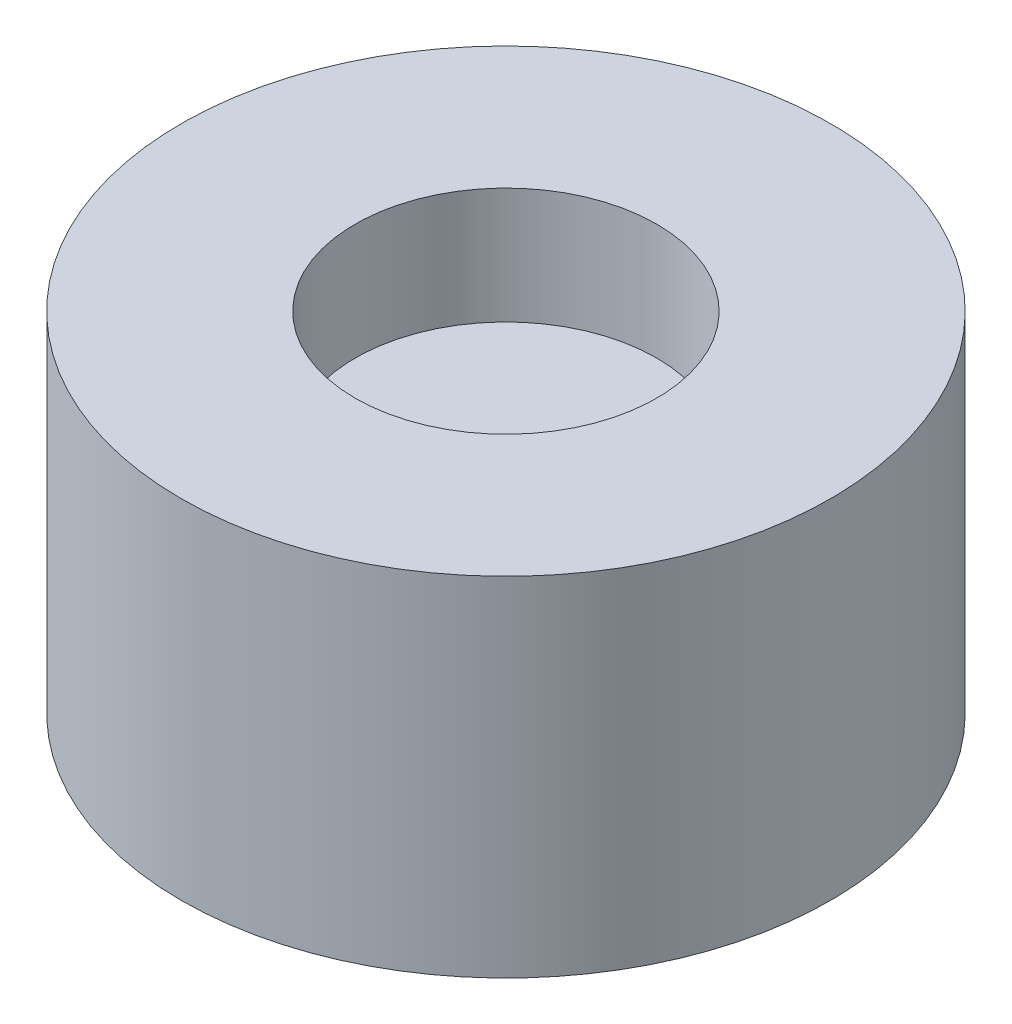
ISO-10303-21;
HEADER;
FILE_DESCRIPTION(('STEP AP214'),'2;1');
FILE_NAME('part.step','',(''),(''),'','','');
FILE_SCHEMA(('AUTOMOTIVE_DESIGN { 1 0 10303 214 1 1 1 1 }'));
ENDSEC;
DATA;
#1=APPLICATION_CONTEXT('core data for automotive mechanical design processes');
#2=APPLICATION_PROTOCOL_DEFINITION('international standard','automotive_design',2000,#1);
#3=PRODUCT_CONTEXT('',#1,'mechanical');
#4=PRODUCT('Part','Part','',(#3));
#5=PRODUCT_RELATED_PRODUCT_CATEGORY('part','',(#4));
#6=PRODUCT_DEFINITION_FORMATION('','',#4);
#7=PRODUCT_DEFINITION_CONTEXT('part definition',#1,'design');
#8=PRODUCT_DEFINITION('design','',#6,#7);
#9=PRODUCT_DEFINITION_SHAPE('','',#8);
#10=(LENGTH_UNIT() NAMED_UNIT(*) SI_UNIT(.MILLI.,.METRE.));
#11=(NAMED_UNIT(*) PLANE_ANGLE_UNIT() SI_UNIT($,.RADIAN.));
#12=(NAMED_UNIT(*) SI_UNIT($,.STERADIAN.) SOLID_ANGLE_UNIT());
#13=UNCERTAINTY_MEASURE_WITH_UNIT(LENGTH_MEASURE(1.E-05),#10,'distance_accuracy_value','');
#14=(GEOMETRIC_REPRESENTATION_CONTEXT(3) GLOBAL_UNCERTAINTY_ASSIGNED_CONTEXT((#13)) GLOBAL_UNIT_ASSIGNED_CONTEXT((#10,
#11,#12)) REPRESENTATION_CONTEXT('',''));
#15=CARTESIAN_POINT('',(0.,0.,0.));
#16=DIRECTION('',(0.,0.,1.));
#17=DIRECTION('',(1.,0.,0.));
#18=AXIS2_PLACEMENT_3D('',#15,#16,#17);
#19=CARTESIAN_POINT('',(0.,6.,0.));
#20=DIRECTION('',(0.,-1.,0.));
#21=DIRECTION('',(0.,0.,-1.));
#22=AXIS2_PLACEMENT_3D('',#19,#20,#21);
#23=CYLINDRICAL_SURFACE('',#22,4.6);
#24=CARTESIAN_POINT('',(0.,3.,0.));
#25=DIRECTION('',(0.,1.,0.));
#26=DIRECTION('',(0.,0.,1.));
#27=AXIS2_PLACEMENT_3D('',#24,#25,#26);
#28=CIRCLE('',#27,4.6);
#29=CARTESIAN_POINT('',(-0.95,3.,-4.50083325618713));
#30=VERTEX_POINT('',#29);
#31=CARTESIAN_POINT('',(0.95,3.,-4.50083325618713));
#32=VERTEX_POINT('',#31);
#33=EDGE_CURVE('E98',#30,#32,#28,.T.);
#34=ORIENTED_EDGE('',*,*,#33,.F.);
#35=DIRECTION('',(0.,-1.,0.));
#36=VECTOR('',#35,1.);
#37=CARTESIAN_POINT('',(-0.95,6.,-4.50083325618713));
#38=LINE('',#37,#36);
#39=CARTESIAN_POINT('',(-0.95,6.,-4.50083325618713));
#40=VERTEX_POINT('',#39);
#41=EDGE_CURVE('E42',#40,#30,#38,.T.);
#42=ORIENTED_EDGE('',*,*,#41,.F.);
#43=CARTESIAN_POINT('',(0.,6.,0.));
#44=DIRECTION('',(0.,1.,0.));
#45=DIRECTION('',(0.,0.,1.));
#46=AXIS2_PLACEMENT_3D('',#43,#44,#45);
#47=CIRCLE('',#46,4.6);
#48=CARTESIAN_POINT('',(0.95,6.,-4.50083325618713));
#49=VERTEX_POINT('',#48);
#50=EDGE_CURVE('E77',#40,#49,#47,.T.);
#51=ORIENTED_EDGE('',*,*,#50,.T.);
#52=DIRECTION('',(0.,-1.,0.));
#53=VECTOR('',#52,1.);
#54=CARTESIAN_POINT('',(0.95,6.,-4.50083325618713));
#55=LINE('',#54,#53);
#56=EDGE_CURVE('E71',#49,#32,#55,.T.);
#57=ORIENTED_EDGE('',*,*,#56,.T.);
#58=EDGE_LOOP('',(#34,#42,#51,#57));
#59=FACE_BOUND('',#58,.T.);
#60=ADVANCED_FACE('F34',(#59),#23,.F.);
#61=CARTESIAN_POINT('',(-0.949999999999998,6.,0.));
#62=DIRECTION('',(-1.,0.,0.));
#63=DIRECTION('',(0.,0.,1.));
#64=AXIS2_PLACEMENT_3D('',#61,#62,#63);
#65=PLANE('',#64);
#66=DIRECTION('',(0.,0.,-1.));
#67=VECTOR('',#66,1.);
#68=CARTESIAN_POINT('',(-0.949999999999998,3.,0.));
#69=LINE('',#68,#67);
#70=CARTESIAN_POINT('',(-0.95,3.,-3.75));
#71=VERTEX_POINT('',#70);
#72=EDGE_CURVE('E100',#71,#30,#69,.T.);
#73=ORIENTED_EDGE('',*,*,#72,.F.);
#74=DIRECTION('',(0.,-1.,0.));
#75=VECTOR('',#74,1.);
#76=CARTESIAN_POINT('',(-0.95,6.,-3.75));
#77=LINE('',#76,#75);
#78=CARTESIAN_POINT('',(-0.95,6.,-3.75));
#79=VERTEX_POINT('',#78);
#80=EDGE_CURVE('E109',#79,#71,#77,.T.);
#81=ORIENTED_EDGE('',*,*,#80,.F.);
#82=DIRECTION('',(0.,0.,-1.));
#83=VECTOR('',#82,1.);
#84=CARTESIAN_POINT('',(-0.949999999999998,6.,0.));
#85=LINE('',#84,#83);
#86=EDGE_CURVE('E81',#79,#40,#85,.T.);
#87=ORIENTED_EDGE('',*,*,#86,.T.);
#88=ORIENTED_EDGE('',*,*,#41,.T.);
#89=EDGE_LOOP('',(#73,#81,#87,#88));
#90=FACE_BOUND('',#89,.T.);
#91=ADVANCED_FACE('F112',(#90),#65,.T.);
#92=CARTESIAN_POINT('',(0.,6.,-3.75));
#93=DIRECTION('',(0.,0.,-1.));
#94=DIRECTION('',(-1.,0.,0.));
#95=AXIS2_PLACEMENT_3D('',#92,#93,#94);
#96=PLANE('',#95);
#97=DIRECTION('',(1.,0.,0.));
#98=VECTOR('',#97,1.);
#99=CARTESIAN_POINT('',(0.,3.,-3.75));
#100=LINE('',#99,#98);
#101=CARTESIAN_POINT('',(0.95,3.,-3.75));
#102=VERTEX_POINT('',#101);
#103=EDGE_CURVE('E65',#71,#102,#100,.T.);
#104=ORIENTED_EDGE('',*,*,#103,.T.);
#105=DIRECTION('',(0.,-1.,0.));
#106=VECTOR('',#105,1.);
#107=CARTESIAN_POINT('',(0.95,6.,-3.75));
#108=LINE('',#107,#106);
#109=CARTESIAN_POINT('',(0.95,6.,-3.75));
#110=VERTEX_POINT('',#109);
#111=EDGE_CURVE('E50',#110,#102,#108,.T.);
#112=ORIENTED_EDGE('',*,*,#111,.F.);
#113=DIRECTION('',(1.,0.,0.));
#114=VECTOR('',#113,1.);
#115=CARTESIAN_POINT('',(0.,6.,-3.75));
#116=LINE('',#115,#114);
#117=EDGE_CURVE('E93',#79,#110,#116,.T.);
#118=ORIENTED_EDGE('',*,*,#117,.F.);
#119=ORIENTED_EDGE('',*,*,#80,.T.);
#120=EDGE_LOOP('',(#104,#112,#118,#119));
#121=FACE_BOUND('',#120,.T.);
#122=ADVANCED_FACE('F151',(#121),#96,.F.);
#123=CARTESIAN_POINT('',(0.95,6.,0.));
#124=DIRECTION('',(-1.,0.,0.));
#125=DIRECTION('',(0.,0.,1.));
#126=AXIS2_PLACEMENT_3D('',#123,#124,#125);
#127=PLANE('',#126);
#128=DIRECTION('',(0.,0.,-1.));
#129=VECTOR('',#128,1.);
#130=CARTESIAN_POINT('',(0.95,3.,0.));
#131=LINE('',#130,#129);
#132=EDGE_CURVE('E89',#102,#32,#131,.T.);
#133=ORIENTED_EDGE('',*,*,#132,.T.);
#134=ORIENTED_EDGE('',*,*,#56,.F.);
#135=DIRECTION('',(0.,0.,-1.));
#136=VECTOR('',#135,1.);
#137=CARTESIAN_POINT('',(0.95,6.,0.));
#138=LINE('',#137,#136);
#139=EDGE_CURVE('E86',#110,#49,#138,.T.);
#140=ORIENTED_EDGE('',*,*,#139,.F.);
#141=ORIENTED_EDGE('',*,*,#111,.T.);
#142=EDGE_LOOP('',(#133,#134,#140,#141));
#143=FACE_BOUND('',#142,.T.);
#144=ADVANCED_FACE('F85',(#143),#127,.F.);
#145=CARTESIAN_POINT('',(0.,6.,0.));
#146=DIRECTION('',(0.,-1.,0.));
#147=DIRECTION('',(0.,0.,-1.));
#148=AXIS2_PLACEMENT_3D('',#145,#146,#147);
#149=CYLINDRICAL_SURFACE('',#148,5.6);
#150=CARTESIAN_POINT('',(0.,3.,0.));
#151=DIRECTION('',(0.,1.,0.));
#152=DIRECTION('',(0.,0.,1.));
#153=AXIS2_PLACEMENT_3D('',#150,#151,#152);
#154=CIRCLE('',#153,5.6);
#155=CARTESIAN_POINT('',(0.,3.,5.6));
#156=VERTEX_POINT('',#155);
#157=EDGE_CURVE('E82',#156,#156,#154,.T.);
#158=ORIENTED_EDGE('',*,*,#157,.T.);
#159=EDGE_LOOP('',(#158));
#160=FACE_BOUND('',#159,.T.);
#161=CARTESIAN_POINT('',(0.,9.,0.));
#162=DIRECTION('',(0.,1.,0.));
#163=DIRECTION('',(0.,0.,1.));
#164=AXIS2_PLACEMENT_3D('',#161,#162,#163);
#165=CIRCLE('',#164,5.6);
#166=CARTESIAN_POINT('',(0.,9.,5.6));
#167=VERTEX_POINT('',#166);
#168=EDGE_CURVE('E101',#167,#167,#165,.T.);
#169=ORIENTED_EDGE('',*,*,#168,.F.);
#170=EDGE_LOOP('',(#169));
#171=FACE_BOUND('',#170,.T.);
#172=ADVANCED_FACE('F117',(#160,#171),#149,.T.);
#173=CARTESIAN_POINT('',(0.,3.,0.));
#174=DIRECTION('',(0.,1.,0.));
#175=DIRECTION('',(0.,0.,1.));
#176=AXIS2_PLACEMENT_3D('',#173,#174,#175);
#177=PLANE('',#176);
#178=ORIENTED_EDGE('',*,*,#33,.T.);
#179=ORIENTED_EDGE('',*,*,#132,.F.);
#180=ORIENTED_EDGE('',*,*,#103,.F.);
#181=ORIENTED_EDGE('',*,*,#72,.T.);
#182=EDGE_LOOP('',(#178,#179,#180,#181));
#183=FACE_BOUND('',#182,.T.);
#184=ORIENTED_EDGE('',*,*,#157,.F.);
#185=EDGE_LOOP('',(#184));
#186=FACE_BOUND('',#185,.T.);
#187=ADVANCED_FACE('F114',(#183,#186),#177,.F.);
#188=CARTESIAN_POINT('',(0.,6.,0.));
#189=DIRECTION('',(0.,1.,0.));
#190=DIRECTION('',(0.,0.,1.));
#191=AXIS2_PLACEMENT_3D('',#188,#189,#190);
#192=PLANE('',#191);
#193=ORIENTED_EDGE('',*,*,#50,.F.);
#194=ORIENTED_EDGE('',*,*,#86,.F.);
#195=ORIENTED_EDGE('',*,*,#117,.T.);
#196=ORIENTED_EDGE('',*,*,#139,.T.);
#197=EDGE_LOOP('',(#193,#194,#195,#196));
#198=FACE_BOUND('',#197,.T.);
#199=ADVANCED_FACE('F92',(#198),#192,.F.);
#200=CARTESIAN_POINT('',(0.,9.,0.));
#201=DIRECTION('',(0.,1.,0.));
#202=DIRECTION('',(0.,0.,1.));
#203=AXIS2_PLACEMENT_3D('',#200,#201,#202);
#204=PLANE('',#203);
#205=ORIENTED_EDGE('',*,*,#168,.T.);
#206=EDGE_LOOP('',(#205));
#207=FACE_BOUND('',#206,.T.);
#208=CARTESIAN_POINT('',(0.,9.,0.));
#209=DIRECTION('',(0.,1.,0.));
#210=DIRECTION('',(0.,0.,1.));
#211=AXIS2_PLACEMENT_3D('',#208,#209,#210);
#212=CIRCLE('',#211,2.6);
#213=CARTESIAN_POINT('',(0.,9.,2.6));
#214=VERTEX_POINT('',#213);
#215=EDGE_CURVE('E127',#214,#214,#212,.T.);
#216=ORIENTED_EDGE('',*,*,#215,.F.);
#217=EDGE_LOOP('',(#216));
#218=FACE_BOUND('',#217,.T.);
#219=ADVANCED_FACE('F136',(#207,#218),#204,.T.);
#220=CARTESIAN_POINT('',(0.,9.,0.));
#221=DIRECTION('',(0.,-1.,0.));
#222=DIRECTION('',(0.,0.,-1.));
#223=AXIS2_PLACEMENT_3D('',#220,#221,#222);
#224=CYLINDRICAL_SURFACE('',#223,2.6);
#225=ORIENTED_EDGE('',*,*,#215,.T.);
#226=EDGE_LOOP('',(#225));
#227=FACE_BOUND('',#226,.T.);
#228=CARTESIAN_POINT('',(0.,7.,0.));
#229=DIRECTION('',(0.,1.,0.));
#230=DIRECTION('',(0.,0.,1.));
#231=AXIS2_PLACEMENT_3D('',#228,#229,#230);
#232=CIRCLE('',#231,2.6);
#233=CARTESIAN_POINT('',(0.,7.,2.6));
#234=VERTEX_POINT('',#233);
#235=EDGE_CURVE('E11',#234,#234,#232,.F.);
#236=ORIENTED_EDGE('',*,*,#235,.T.);
#237=EDGE_LOOP('',(#236));
#238=FACE_BOUND('',#237,.T.);
#239=ADVANCED_FACE('F133',(#227,#238),#224,.F.);
#240=CARTESIAN_POINT('',(0.,7.,0.));
#241=DIRECTION('',(0.,1.,0.));
#242=DIRECTION('',(0.,0.,1.));
#243=AXIS2_PLACEMENT_3D('',#240,#241,#242);
#244=PLANE('',#243);
#245=ORIENTED_EDGE('',*,*,#235,.F.);
#246=EDGE_LOOP('',(#245));
#247=FACE_BOUND('',#246,.T.);
#248=ADVANCED_FACE('F143',(#247),#244,.T.);
#249=CLOSED_SHELL('',(#60,#91,#122,#144,#172,#187,#199,#219,#239,#248));
#250=MANIFOLD_SOLID_BREP('B2',#249);
#251=ADVANCED_BREP_SHAPE_REPRESENTATION('',(#18,#250),#14);
#252=SHAPE_DEFINITION_REPRESENTATION(#9,#251);
ENDSEC;
END-ISO-10303-21;
